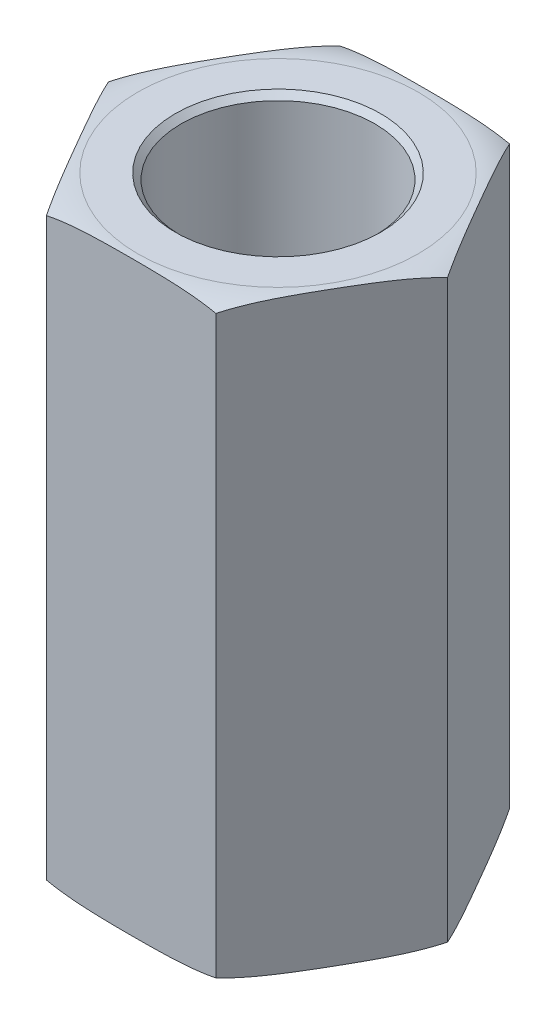
ISO-10303-21;
HEADER;
FILE_DESCRIPTION(('STEP AP214'),'2;1');
FILE_NAME('part.step','',(''),(''),'','','');
FILE_SCHEMA(('AUTOMOTIVE_DESIGN { 1 0 10303 214 1 1 1 1 }'));
ENDSEC;
DATA;
#1=APPLICATION_CONTEXT('core data for automotive mechanical design processes');
#2=APPLICATION_PROTOCOL_DEFINITION('international standard','automotive_design',2000,#1);
#3=PRODUCT_CONTEXT('',#1,'mechanical');
#4=PRODUCT('Part','Part','',(#3));
#5=PRODUCT_RELATED_PRODUCT_CATEGORY('part','',(#4));
#6=PRODUCT_DEFINITION_FORMATION('','',#4);
#7=PRODUCT_DEFINITION_CONTEXT('part definition',#1,'design');
#8=PRODUCT_DEFINITION('design','',#6,#7);
#9=PRODUCT_DEFINITION_SHAPE('','',#8);
#10=(LENGTH_UNIT() NAMED_UNIT(*) SI_UNIT(.MILLI.,.METRE.));
#11=(NAMED_UNIT(*) PLANE_ANGLE_UNIT() SI_UNIT($,.RADIAN.));
#12=(NAMED_UNIT(*) SI_UNIT($,.STERADIAN.) SOLID_ANGLE_UNIT());
#13=UNCERTAINTY_MEASURE_WITH_UNIT(LENGTH_MEASURE(1.E-05),#10,'distance_accuracy_value','');
#14=(GEOMETRIC_REPRESENTATION_CONTEXT(3) GLOBAL_UNCERTAINTY_ASSIGNED_CONTEXT((#13)) GLOBAL_UNIT_ASSIGNED_CONTEXT((#10,
#11,#12)) REPRESENTATION_CONTEXT('',''));
#15=CARTESIAN_POINT('',(0.,0.,0.));
#16=DIRECTION('',(0.,0.,1.));
#17=DIRECTION('',(1.,0.,0.));
#18=AXIS2_PLACEMENT_3D('',#15,#16,#17);
#19=CARTESIAN_POINT('',(3.6661742093542,6.34999999999997,-1.38777878078145E-13));
#20=DIRECTION('',(-0.866025403784443,0.,0.500000000000002));
#21=DIRECTION('',(0.500000000000002,0.,0.866025403784443));
#22=AXIS2_PLACEMENT_3D('',#19,#20,#21);
#23=PLANE('',#22);
#24=DIRECTION('',(0.,1.,0.));
#25=VECTOR('',#24,1.);
#26=CARTESIAN_POINT('',(1.83308710467728,6.34999999999997,-3.17500000000029));
#27=LINE('',#26,#25);
#28=CARTESIAN_POINT('',(1.83308710467703,-6.22300000000003,-3.17500000000004));
#29=VERTEX_POINT('',#28);
#30=CARTESIAN_POINT('',(1.83308710467728,6.22299999999998,-3.17500000000029));
#31=VERTEX_POINT('',#30);
#32=EDGE_CURVE('E144',#29,#31,#27,.T.);
#33=ORIENTED_EDGE('',*,*,#32,.T.);
#34=CARTESIAN_POINT('',(3.66617420935417,6.22299999999998,-1.11022302462516E-13));
#35=CARTESIAN_POINT('',(3.62797961467402,6.23890141489973,-0.0661549785606769));
#36=CARTESIAN_POINT('',(3.58956810864165,6.25248860761058,-0.132685658604));
#37=CARTESIAN_POINT('',(3.51249051795719,6.2758161979403,-0.266187961794495));
#38=CARTESIAN_POINT('',(3.47382473049854,6.28556047713982,-0.333159070187531));
#39=CARTESIAN_POINT('',(3.3964163186788,6.30199665304516,-0.467234372392529));
#40=CARTESIAN_POINT('',(3.35767399633319,6.30869453286697,-0.534338043098334));
#41=CARTESIAN_POINT('',(3.2800983462012,6.31977675729325,-0.668703010557135));
#42=CARTESIAN_POINT('',(3.24126499587778,6.32416045047401,-0.735964346345423));
#43=CARTESIAN_POINT('',(3.16354065964321,6.33124030042632,-0.870586845688255));
#44=CARTESIAN_POINT('',(3.12464965374482,6.33393552375916,-0.937948043861727));
#45=CARTESIAN_POINT('',(3.04685144594599,6.33815319837137,-1.0726984925071));
#46=CARTESIAN_POINT('',(3.00794424351976,6.3396756080272,-1.14008774388971));
#47=CARTESIAN_POINT('',(2.9305151759888,6.34192270588906,-1.27419882283602));
#48=CARTESIAN_POINT('',(2.89199336248941,6.34265524681811,-1.34092056101665));
#49=CARTESIAN_POINT('',(2.8149477834615,6.34357673025744,-1.47436741839156));
#50=CARTESIAN_POINT('',(2.77642401791445,6.34376566589493,-1.54109253761791));
#51=CARTESIAN_POINT('',(2.69935964431018,6.34366599668059,-1.67457194815398));
#52=CARTESIAN_POINT('',(2.66081903631827,6.34337718117658,-1.74132623935056));
#53=CARTESIAN_POINT('',(2.58373908085335,6.34222198621902,-1.87483263846095));
#54=CARTESIAN_POINT('',(2.5451997334125,6.34135559703859,-1.94158474631904));
#55=CARTESIAN_POINT('',(2.46812969629777,6.33878619406568,-2.07507396634301));
#56=CARTESIAN_POINT('',(2.42959900625973,6.33708322716172,-2.14181107913963));
#57=CARTESIAN_POINT('',(2.3525565134091,6.33243872297262,-2.27525259109854));
#58=CARTESIAN_POINT('',(2.31404470975435,6.32949724713574,-2.34195699171947));
#59=CARTESIAN_POINT('',(2.2508420623994,6.32321741247486,-2.45142718811118));
#60=CARTESIAN_POINT('',(2.22613849337012,6.32039801104636,-2.49421502479834));
#61=CARTESIAN_POINT('',(2.17676945272234,6.31386967943045,-2.57972471152133));
#62=CARTESIAN_POINT('',(2.15210397034188,6.31016108091398,-2.62244658019744));
#63=CARTESIAN_POINT('',(2.10282753811699,6.30168027114976,-2.70779586442664));
#64=CARTESIAN_POINT('',(2.07821657107533,6.29690846570092,-2.75042330976622));
#65=CARTESIAN_POINT('',(2.02900094683554,6.28609877125168,-2.83566727147576));
#66=CARTESIAN_POINT('',(2.00439646085468,6.2800577313085,-2.87828349128873));
#67=CARTESIAN_POINT('',(1.95527325900937,6.26651383541622,-2.96336737271525));
#68=CARTESIAN_POINT('',(1.93075459617616,6.25901019780308,-3.00583494247599));
#69=CARTESIAN_POINT('',(1.88182157373177,6.24232035070854,-3.09058942351766));
#70=CARTESIAN_POINT('',(1.8574074405328,6.23313149780335,-3.13287594264113));
#71=CARTESIAN_POINT('',(1.83308710467728,6.22299999999998,-3.17500000000029));
#72=B_SPLINE_CURVE_WITH_KNOTS('',3,(#34,#35,#36,#37,#38,#39,#40,#41,#42,#43,#44,#45,#46,#47,#48,
#49,#50,#51,#52,#53,#54,#55,#56,#57,#58,#59,#60,#61,#62,#63,#64,#65,#66,#67,#68,#69,#70,#71),
.UNSPECIFIED.,.F.,.F.,(4,2,2,2,2,2,2,2,2,2,2,2,2,2,2,2,2,2,4),(0.,0.23397730781796,
0.467717675040727,0.700996973557538,0.934341903229792,1.16781571967244,1.40129782179829,
1.63243665809674,1.86357841666622,2.094822118463,2.32606971471501,2.55730435147405,
2.78852751694421,2.93698369265096,3.08538458004482,3.23372892334593,3.38244598546621,
3.53124274626093,3.68027493713595),.UNSPECIFIED.);
#73=CARTESIAN_POINT('',(3.66617420935417,6.22299999999998,-1.11022302462516E-13));
#74=VERTEX_POINT('',#73);
#75=EDGE_CURVE('E96',#74,#31,#72,.T.);
#76=ORIENTED_EDGE('',*,*,#75,.F.);
#77=DIRECTION('',(0.,1.,0.));
#78=VECTOR('',#77,1.);
#79=CARTESIAN_POINT('',(3.6661742093542,6.34999999999997,-1.38777878078145E-13));
#80=LINE('',#79,#78);
#81=CARTESIAN_POINT('',(3.66617420935417,-6.22300000000003,0.));
#82=VERTEX_POINT('',#81);
#83=EDGE_CURVE('E146',#74,#82,#80,.F.);
#84=ORIENTED_EDGE('',*,*,#83,.T.);
#85=CARTESIAN_POINT('',(1.83308710467728,-6.22300000000003,-3.17500000000029));
#86=CARTESIAN_POINT('',(1.87128169935735,-6.23890141489965,-3.10884502143965));
#87=CARTESIAN_POINT('',(1.90969320538968,-6.25248860761044,-3.0423143413963));
#88=CARTESIAN_POINT('',(1.98677079607412,-6.27581619794014,-2.90881203820579));
#89=CARTESIAN_POINT('',(2.02543658353278,-6.28556047713968,-2.84184092981276));
#90=CARTESIAN_POINT('',(2.10284499535252,-6.30199665304505,-2.70776562760777));
#91=CARTESIAN_POINT('',(2.14158731769813,-6.30869453286687,-2.64066195690196));
#92=CARTESIAN_POINT('',(2.21916296783013,-6.31977675729316,-2.50629698944315));
#93=CARTESIAN_POINT('',(2.25799631815355,-6.32416045047393,-2.43903565365485));
#94=CARTESIAN_POINT('',(2.33572065438812,-6.33124030042626,-2.30441315431201));
#95=CARTESIAN_POINT('',(2.37461166028652,-6.33393552375909,-2.23705195613853));
#96=CARTESIAN_POINT('',(2.45240986808535,-6.33815319837132,-2.10230150749314));
#97=CARTESIAN_POINT('',(2.49131707051159,-6.33967560802715,-2.03491225611053));
#98=CARTESIAN_POINT('',(2.56874613804256,-6.34192270588902,-1.90080117716421));
#99=CARTESIAN_POINT('',(2.60726795154195,-6.34265524681807,-1.83407943898357));
#100=CARTESIAN_POINT('',(2.68431353056987,-6.3435767302574,-1.70063258160865));
#101=CARTESIAN_POINT('',(2.72283729611692,-6.34376566589489,-1.6339074623823));
#102=CARTESIAN_POINT('',(2.79990166972119,-6.34366599668055,-1.50042805184622));
#103=CARTESIAN_POINT('',(2.83844227771311,-6.34337718117654,-1.43367376064963));
#104=CARTESIAN_POINT('',(2.91552223317803,-6.34222198621898,-1.30016736153924));
#105=CARTESIAN_POINT('',(2.95406158061887,-6.34135559703856,-1.23341525368113));
#106=CARTESIAN_POINT('',(3.03113161773364,-6.33878619406561,-1.09992603365717));
#107=CARTESIAN_POINT('',(3.06966230777173,-6.33708322716162,-1.03318892086058));
#108=CARTESIAN_POINT('',(3.14670480062223,-6.3324387229726,-0.899747408901587));
#109=CARTESIAN_POINT('',(3.1852166042768,-6.32949724713584,-0.83304300828054));
#110=CARTESIAN_POINT('',(3.24841925163182,-6.32321741247489,-0.723572811888885));
#111=CARTESIAN_POINT('',(3.27312282066122,-6.3203980110463,-0.680784975201817));
#112=CARTESIAN_POINT('',(3.32249186130908,-6.31386967943032,-0.595275288478904));
#113=CARTESIAN_POINT('',(3.3471573436895,-6.31016108091386,-0.552553419802778));
#114=CARTESIAN_POINT('',(3.39643377591436,-6.30168027114966,-0.467204135573578));
#115=CARTESIAN_POINT('',(3.42104474295602,-6.2969084657008,-0.424576690234015));
#116=CARTESIAN_POINT('',(3.47026036719581,-6.28609877125155,-0.339332728524493));
#117=CARTESIAN_POINT('',(3.49486485317667,-6.28005773130838,-0.296716508711529));
#118=CARTESIAN_POINT('',(3.54398805502196,-6.26651383541608,-0.211632627285027));
#119=CARTESIAN_POINT('',(3.56850671785515,-6.25901019780292,-0.169165057524298));
#120=CARTESIAN_POINT('',(3.61743974029956,-6.24232035070841,-0.0844105764826494));
#121=CARTESIAN_POINT('',(3.64185387349856,-6.23313149780327,-0.0421240573592005));
#122=CARTESIAN_POINT('',(3.66617420935417,-6.22300000000003,0.));
#123=B_SPLINE_CURVE_WITH_KNOTS('',3,(#85,#86,#87,#88,#89,#90,#91,#92,#93,#94,#95,#96,#97,#98,
#99,#100,#101,#102,#103,#104,#105,#106,#107,#108,#109,#110,#111,#112,#113,#114,#115,#116,#117,
#118,#119,#120,#121,#122),.UNSPECIFIED.,.F.,.F.,(4,2,2,2,2,2,2,2,2,2,2,2,2,2,2,2,2,2,4),(0.,
0.233977307817952,0.467717675040719,0.700996973557547,0.934341903229817,1.16781571967249,
1.40129782179836,1.63243665809683,1.86357841666633,2.09482211846312,2.32606971471515,
2.55730435147419,2.78852751694437,2.93698369265108,3.08538458004492,3.233728923346,
3.38244598546625,3.53124274626094,3.68027493713592),.UNSPECIFIED.);
#124=EDGE_CURVE('E224',#29,#82,#123,.T.);
#125=ORIENTED_EDGE('',*,*,#124,.F.);
#126=EDGE_LOOP('',(#33,#76,#84,#125));
#127=FACE_BOUND('',#126,.T.);
#128=ADVANCED_FACE('F16',(#127),#23,.F.);
#129=CARTESIAN_POINT('',(1.83308710467711,6.35000000000002,3.17499999999996));
#130=DIRECTION('',(-0.866025403784444,0.,-0.500000000000003));
#131=DIRECTION('',(-0.500000000000003,0.,0.866025403784444));
#132=AXIS2_PLACEMENT_3D('',#129,#130,#131);
#133=PLANE('',#132);
#134=ORIENTED_EDGE('',*,*,#83,.F.);
#135=CARTESIAN_POINT('',(1.83308710467711,6.22299999999998,3.17499999999996));
#136=CARTESIAN_POINT('',(1.87128169935729,6.23890141489967,3.10884502143939));
#137=CARTESIAN_POINT('',(1.90969320538967,6.25248860761049,3.04231434139607));
#138=CARTESIAN_POINT('',(1.98677079607413,6.2758161979402,2.90881203820558));
#139=CARTESIAN_POINT('',(2.02543658353278,6.28556047713974,2.84184092981254));
#140=CARTESIAN_POINT('',(2.10284499535251,6.3019966530451,2.70776562760755));
#141=CARTESIAN_POINT('',(2.14158731769812,6.30869453286691,2.64066195690174));
#142=CARTESIAN_POINT('',(2.21916296783012,6.3197767572932,2.50629698944294));
#143=CARTESIAN_POINT('',(2.25799631815354,6.32416045047396,2.43903565365465));
#144=CARTESIAN_POINT('',(2.33572065438811,6.33124030042629,2.30441315431181));
#145=CARTESIAN_POINT('',(2.3746116602865,6.33393552375912,2.23705195613834));
#146=CARTESIAN_POINT('',(2.45240986808533,6.33815319837135,2.10230150749296));
#147=CARTESIAN_POINT('',(2.49131707051157,6.33967560802718,2.03491225611035));
#148=CARTESIAN_POINT('',(2.56874613804253,6.34192270588904,1.90080117716404));
#149=CARTESIAN_POINT('',(2.60726795154192,6.34265524681809,1.8340794389834));
#150=CARTESIAN_POINT('',(2.68431353056983,6.34357673025742,1.7006325816085));
#151=CARTESIAN_POINT('',(2.72283729611688,6.34376566589491,1.63390746238214));
#152=CARTESIAN_POINT('',(2.79990166972115,6.34366599668057,1.50042805184608));
#153=CARTESIAN_POINT('',(2.83844227771306,6.34337718117657,1.43367376064949));
#154=CARTESIAN_POINT('',(2.91552223317798,6.34222198621901,1.3001673615391));
#155=CARTESIAN_POINT('',(2.95406158061883,6.34135559703858,1.233415253681));
#156=CARTESIAN_POINT('',(3.03113161773358,6.33878619406565,1.09992603365704));
#157=CARTESIAN_POINT('',(3.06966230777165,6.33708322716169,1.03318892086044));
#158=CARTESIAN_POINT('',(3.14670480062219,6.33243872297261,0.899747408901476));
#159=CARTESIAN_POINT('',(3.18521660427681,6.32949724713575,0.833043008280466));
#160=CARTESIAN_POINT('',(3.24841925163181,6.32321741247486,0.723572811888789));
#161=CARTESIAN_POINT('',(3.27312282066118,6.32039801104634,0.68078497520169));
#162=CARTESIAN_POINT('',(3.32249186130902,6.31386967943042,0.595275288478746));
#163=CARTESIAN_POINT('',(3.34715734368946,6.31016108091395,0.552553419802622));
#164=CARTESIAN_POINT('',(3.39643377591432,6.30168027114973,0.467204135573417));
#165=CARTESIAN_POINT('',(3.42104474295599,6.29690846570089,0.424576690233846));
#166=CARTESIAN_POINT('',(3.47026036719578,6.28609877125165,0.339332728524313));
#167=CARTESIAN_POINT('',(3.49486485317664,6.28005773130848,0.296716508711345));
#168=CARTESIAN_POINT('',(3.54398805502194,6.26651383541619,0.211632627284831));
#169=CARTESIAN_POINT('',(3.56850671785514,6.25901019780305,0.169165057524093));
#170=CARTESIAN_POINT('',(3.61743974029956,6.24232035070852,0.0844105764824377));
#171=CARTESIAN_POINT('',(3.64185387349856,6.23313149780334,0.0421240573589902));
#172=CARTESIAN_POINT('',(3.66617420935417,6.22299999999998,-1.11022302462516E-13));
#173=B_SPLINE_CURVE_WITH_KNOTS('',3,(#135,#136,#137,#138,#139,#140,#141,#142,#143,#144,#145,
#146,#147,#148,#149,#150,#151,#152,#153,#154,#155,#156,#157,#158,#159,#160,#161,#162,#163,#164,
#165,#166,#167,#168,#169,#170,#171,#172),.UNSPECIFIED.,.F.,.F.,(4,2,2,2,2,2,2,2,2,2,2,2,2,2,2,2,
2,2,4),(0.,0.233977307817958,0.467717675040725,0.70099697355754,0.934341903229799,
1.16781571967245,1.40129782179831,1.63243665809676,1.86357841666625,2.09482211846303,
2.32606971471505,2.55730435147409,2.78852751694425,2.93698369265099,3.08538458004484,
3.23372892334594,3.38244598546621,3.53124274626092,3.68027493713592),.UNSPECIFIED.);
#174=CARTESIAN_POINT('',(1.83308710467711,6.22299999999998,3.17499999999996));
#175=VERTEX_POINT('',#174);
#176=EDGE_CURVE('E217',#175,#74,#173,.T.);
#177=ORIENTED_EDGE('',*,*,#176,.F.);
#178=DIRECTION('',(0.,1.,0.));
#179=VECTOR('',#178,1.);
#180=CARTESIAN_POINT('',(1.83308710467711,6.35000000000002,3.17499999999996));
#181=LINE('',#180,#179);
#182=CARTESIAN_POINT('',(1.83308710467708,-6.22299999999998,3.17500000000001));
#183=VERTEX_POINT('',#182);
#184=EDGE_CURVE('E141',#175,#183,#181,.F.);
#185=ORIENTED_EDGE('',*,*,#184,.T.);
#186=CARTESIAN_POINT('',(3.66617420935417,-6.22300000000003,0.));
#187=CARTESIAN_POINT('',(3.627979614674,-6.23890141489968,0.0661549785604945));
#188=CARTESIAN_POINT('',(3.58956810864162,-6.25248860761048,0.132685658603822));
#189=CARTESIAN_POINT('',(3.51249051795716,-6.27581619794018,0.26618796179432));
#190=CARTESIAN_POINT('',(3.47382473049851,-6.28556047713972,0.333159070187355));
#191=CARTESIAN_POINT('',(3.39641631867877,-6.30199665304508,0.467234372392358));
#192=CARTESIAN_POINT('',(3.35767399633316,-6.3086945328669,0.534338043098168));
#193=CARTESIAN_POINT('',(3.28009834620116,-6.31977675729318,0.66870301055698));
#194=CARTESIAN_POINT('',(3.24126499587774,-6.32416045047395,0.735964346345273));
#195=CARTESIAN_POINT('',(3.16354065964316,-6.33124030042628,0.870586845688117));
#196=CARTESIAN_POINT('',(3.12464965374477,-6.33393552375911,0.937948043861596));
#197=CARTESIAN_POINT('',(3.04685144594593,-6.33815319837133,1.07269849250699));
#198=CARTESIAN_POINT('',(3.00794424351969,-6.33967560802717,1.1400877438896));
#199=CARTESIAN_POINT('',(2.93051517598872,-6.34192270588903,1.27419882283592));
#200=CARTESIAN_POINT('',(2.89199336248933,-6.34265524681808,1.34092056101656));
#201=CARTESIAN_POINT('',(2.81494778346141,-6.34357673025741,1.47436741839148));
#202=CARTESIAN_POINT('',(2.77642401791437,-6.3437656658949,1.54109253761783));
#203=CARTESIAN_POINT('',(2.69935964431009,-6.34366599668055,1.67457194815391));
#204=CARTESIAN_POINT('',(2.66081903631818,-6.34337718117655,1.7413262393505));
#205=CARTESIAN_POINT('',(2.58373908085325,-6.34222198621899,1.87483263846089));
#206=CARTESIAN_POINT('',(2.5451997334124,-6.34135559703857,1.94158474631899));
#207=CARTESIAN_POINT('',(2.46812969629765,-6.33878619406562,2.07507396634296));
#208=CARTESIAN_POINT('',(2.4295990062596,-6.33708322716163,2.14181107913957));
#209=CARTESIAN_POINT('',(2.35255651340902,-6.33243872297261,2.27525259109852));
#210=CARTESIAN_POINT('',(2.31404470975434,-6.32949724713583,2.34195699171951));
#211=CARTESIAN_POINT('',(2.25084206239937,-6.3232174124749,2.45142718811119));
#212=CARTESIAN_POINT('',(2.22613849337004,-6.32039801104631,2.4942150247983));
#213=CARTESIAN_POINT('',(2.17676945272223,-6.31386967943034,2.57972471152125));
#214=CARTESIAN_POINT('',(2.15210397034179,-6.31016108091388,2.62244658019736));
#215=CARTESIAN_POINT('',(2.10282753811692,-6.30168027114968,2.70779586442655));
#216=CARTESIAN_POINT('',(2.07821657107526,-6.29690846570083,2.75042330976612));
#217=CARTESIAN_POINT('',(2.02900094683548,-6.28609877125158,2.83566727147564));
#218=CARTESIAN_POINT('',(2.00439646085462,-6.2800577313084,2.8782834912886));
#219=CARTESIAN_POINT('',(1.95527325900933,-6.2665138354161,2.9633673727151));
#220=CARTESIAN_POINT('',(1.93075459617614,-6.25901019780295,3.00583494247584));
#221=CARTESIAN_POINT('',(1.88182157373172,-6.24232035070843,3.09058942351748));
#222=CARTESIAN_POINT('',(1.85740744053271,-6.23313149780327,3.13287594264092));
#223=CARTESIAN_POINT('',(1.83308710467708,-6.22299999999998,3.17500000000001));
#224=B_SPLINE_CURVE_WITH_KNOTS('',3,(#186,#187,#188,#189,#190,#191,#192,#193,#194,#195,#196,
#197,#198,#199,#200,#201,#202,#203,#204,#205,#206,#207,#208,#209,#210,#211,#212,#213,#214,#215,
#216,#217,#218,#219,#220,#221,#222,#223),.UNSPECIFIED.,.F.,.F.,(4,2,2,2,2,2,2,2,2,2,2,2,2,2,2,2,
2,2,4),(0.,0.23397730781796,0.467717675040731,0.700996973557561,0.934341903229834,
1.1678157196725,1.40129782179838,1.63243665809685,1.86357841666635,2.09482211846314,
2.32606971471517,2.55730435147422,2.78852751694439,2.9369836926511,3.08538458004494,
3.23372892334602,3.38244598546627,3.53124274626096,3.68027493713594),.UNSPECIFIED.);
#225=EDGE_CURVE('E246',#82,#183,#224,.T.);
#226=ORIENTED_EDGE('',*,*,#225,.F.);
#227=EDGE_LOOP('',(#134,#177,#185,#226));
#228=FACE_BOUND('',#227,.T.);
#229=ADVANCED_FACE('F221',(#228),#133,.F.);
#230=CARTESIAN_POINT('',(1.83308710467728,6.34999999999997,-3.17500000000029));
#231=DIRECTION('',(0.,0.,1.));
#232=DIRECTION('',(1.,0.,0.));
#233=AXIS2_PLACEMENT_3D('',#230,#231,#232);
#234=PLANE('',#233);
#235=DIRECTION('',(0.,1.,0.));
#236=VECTOR('',#235,1.);
#237=CARTESIAN_POINT('',(-1.83308710467706,6.35000000000002,-3.17500000000001));
#238=LINE('',#237,#236);
#239=CARTESIAN_POINT('',(-1.83308710467706,-6.22299999999998,-3.17500000000001));
#240=VERTEX_POINT('',#239);
#241=CARTESIAN_POINT('',(-1.83308710467706,6.22299999999998,-3.17500000000001));
#242=VERTEX_POINT('',#241);
#243=EDGE_CURVE('E103',#240,#242,#238,.T.);
#244=ORIENTED_EDGE('',*,*,#243,.T.);
#245=CARTESIAN_POINT('',(1.83308710467728,6.22299999999998,-3.17500000000029));
#246=CARTESIAN_POINT('',(1.73237579828705,6.24394001415181,-3.17500000000029));
#247=CARTESIAN_POINT('',(1.63096506893506,6.26088534953277,-3.17500000000029));
#248=CARTESIAN_POINT('',(1.42767146651487,6.28849716439847,-3.17500000000029));
#249=CARTESIAN_POINT('',(1.32579191427271,6.29918756587534,-3.17500000000029));
#250=CARTESIAN_POINT('',(1.12177634709152,6.31612804080796,-3.17500000000029));
#251=CARTESIAN_POINT('',(1.01964056643393,6.3223812707189,-3.17500000000029));
#252=CARTESIAN_POINT('',(0.815663681397492,6.33190280641835,-3.17500000000028));
#253=CARTESIAN_POINT('',(0.713823115514678,6.33518340449992,-3.17500000000027));
#254=CARTESIAN_POINT('',(0.510018485441734,6.3399454848703,-3.17500000000031));
#255=CARTESIAN_POINT('',(0.408054390578049,6.34142541008819,-3.17500000000037));
#256=CARTESIAN_POINT('',(0.20406020033792,6.34331468183793,-3.17500000000021));
#257=CARTESIAN_POINT('',(0.102030100168974,6.34372342414918,-3.17499999999998));
#258=CARTESIAN_POINT('',(-0.102030100168908,6.34372342414918,-3.17499999999998));
#259=CARTESIAN_POINT('',(-0.204060200337843,6.34331468183792,-3.17500000000021));
#260=CARTESIAN_POINT('',(-0.40805439057795,6.34142541008818,-3.17500000000037));
#261=CARTESIAN_POINT('',(-0.510018485441625,6.33994548487029,-3.17500000000031));
#262=CARTESIAN_POINT('',(-0.713823115514547,6.33518340449991,-3.17500000000027));
#263=CARTESIAN_POINT('',(-0.815663681397349,6.33190280641834,-3.17500000000028));
#264=CARTESIAN_POINT('',(-1.01964056643377,6.32238127071888,-3.17500000000029));
#265=CARTESIAN_POINT('',(-1.12177634709135,6.31612804080794,-3.17500000000028));
#266=CARTESIAN_POINT('',(-1.32579191427251,6.29918756587532,-3.17500000000029));
#267=CARTESIAN_POINT('',(-1.42767146651466,6.28849716439844,-3.17500000000032));
#268=CARTESIAN_POINT('',(-1.63096506893483,6.26088534953274,-3.17500000000026));
#269=CARTESIAN_POINT('',(-1.7323757982868,6.24394001415179,-3.17500000000018));
#270=CARTESIAN_POINT('',(-1.83308710467703,6.22299999999998,-3.17499999999998));
#271=B_SPLINE_CURVE_WITH_KNOTS('',3,(#245,#246,#247,#248,#249,#250,#251,#252,#253,#254,#255,
#256,#257,#258,#259,#260,#261,#262,#263,#264,#265,#266,#267,#268,#269,#270),.UNSPECIFIED.,.F.,
.F.,(4,2,2,2,2,2,2,2,2,2,2,2,4),(0.,0.308333242342845,0.615479423308305,0.922406891130111,
1.22805929620863,1.53397581645233,1.84006485747909,2.14615389850582,2.45207041874948,
2.75772282382797,3.06465029164974,3.37179647261517,3.68012971495798),.UNSPECIFIED.);
#272=EDGE_CURVE('E88',#31,#242,#271,.T.);
#273=ORIENTED_EDGE('',*,*,#272,.F.);
#274=ORIENTED_EDGE('',*,*,#32,.F.);
#275=CARTESIAN_POINT('',(-1.83308710467706,-6.22299999999998,-3.17500000000001));
#276=CARTESIAN_POINT('',(-1.73237579828682,-6.24394001415172,-3.17500000000019));
#277=CARTESIAN_POINT('',(-1.63096506893483,-6.26088534953265,-3.17500000000026));
#278=CARTESIAN_POINT('',(-1.42767146651465,-6.28849716439834,-3.17500000000032));
#279=CARTESIAN_POINT('',(-1.32579191427249,-6.29918756587524,-3.1750000000003));
#280=CARTESIAN_POINT('',(-1.12177634709131,-6.31612804080788,-3.17500000000028));
#281=CARTESIAN_POINT('',(-1.01964056643372,-6.32238127071882,-3.17500000000029));
#282=CARTESIAN_POINT('',(-0.815663681397281,-6.33190280641829,-3.17500000000029));
#283=CARTESIAN_POINT('',(-0.713823115514469,-6.33518340449986,-3.17500000000029));
#284=CARTESIAN_POINT('',(-0.510018485441529,-6.33994548487025,-3.17500000000029));
#285=CARTESIAN_POINT('',(-0.408054390577846,-6.34142541008814,-3.17500000000028));
#286=CARTESIAN_POINT('',(-0.204060200337721,-6.3433146818379,-3.1750000000003));
#287=CARTESIAN_POINT('',(-0.102030100168777,-6.34372342414918,-3.17500000000032));
#288=CARTESIAN_POINT('',(0.10203010016909,-6.34372342414918,-3.17500000000032));
#289=CARTESIAN_POINT('',(0.204060200338014,-6.34331468183789,-3.1750000000003));
#290=CARTESIAN_POINT('',(0.408054390578097,-6.34142541008813,-3.17500000000028));
#291=CARTESIAN_POINT('',(0.51001848544176,-6.33994548487024,-3.17500000000029));
#292=CARTESIAN_POINT('',(0.71382311551466,-6.33518340449986,-3.17500000000029));
#293=CARTESIAN_POINT('',(0.815663681397452,-6.33190280641828,-3.17500000000029));
#294=CARTESIAN_POINT('',(1.01964056643385,-6.32238127071882,-3.17500000000029));
#295=CARTESIAN_POINT('',(1.12177634709142,-6.31612804080787,-3.17500000000028));
#296=CARTESIAN_POINT('',(1.32579191427256,-6.29918756587523,-3.1750000000003));
#297=CARTESIAN_POINT('',(1.42767146651469,-6.28849716439833,-3.17500000000031));
#298=CARTESIAN_POINT('',(1.63096506893484,-6.26088534953266,-3.17500000000026));
#299=CARTESIAN_POINT('',(1.7323757982868,-6.24394001415174,-3.1750000000002));
#300=CARTESIAN_POINT('',(1.83308710467703,-6.22300000000003,-3.17500000000004));
#301=B_SPLINE_CURVE_WITH_KNOTS('',3,(#275,#276,#277,#278,#279,#280,#281,#282,#283,#284,#285,
#286,#287,#288,#289,#290,#291,#292,#293,#294,#295,#296,#297,#298,#299,#300),.UNSPECIFIED.,.F.,
.F.,(4,2,2,2,2,2,2,2,2,2,2,2,4),(0.,0.308333242342829,0.615479423308284,0.922406891130085,
1.2280592962086,1.53397581645229,1.84006485747905,2.14615389850574,2.45207041874936,
2.75772282382782,3.06465029164956,3.37179647261496,3.68012971495772),.UNSPECIFIED.);
#302=EDGE_CURVE('E105',#240,#29,#301,.T.);
#303=ORIENTED_EDGE('',*,*,#302,.F.);
#304=EDGE_LOOP('',(#244,#273,#274,#303));
#305=FACE_BOUND('',#304,.T.);
#306=ADVANCED_FACE('F104',(#305),#234,.F.);
#307=CARTESIAN_POINT('',(-1.83308710467692,6.35000000000002,3.17499999999973));
#308=DIRECTION('',(0.,0.,-1.));
#309=DIRECTION('',(-1.,0.,0.));
#310=AXIS2_PLACEMENT_3D('',#307,#308,#309);
#311=PLANE('',#310);
#312=ORIENTED_EDGE('',*,*,#184,.F.);
#313=CARTESIAN_POINT('',(-1.83308710467694,6.22300000000003,3.17499999999979));
#314=CARTESIAN_POINT('',(-1.73237579828672,6.24394001415181,3.17499999999975));
#315=CARTESIAN_POINT('',(-1.63096506893475,6.26088534953274,3.17499999999974));
#316=CARTESIAN_POINT('',(-1.4276714665146,6.28849716439842,3.17499999999973));
#317=CARTESIAN_POINT('',(-1.32579191427246,6.29918756587531,3.17499999999973));
#318=CARTESIAN_POINT('',(-1.1217763470913,6.31612804080794,3.17499999999973));
#319=CARTESIAN_POINT('',(-1.01964056643373,6.32238127071888,3.17499999999973));
#320=CARTESIAN_POINT('',(-0.815663681397325,6.33190280641833,3.17499999999974));
#321=CARTESIAN_POINT('',(-0.713823115514529,6.3351834044999,3.17499999999975));
#322=CARTESIAN_POINT('',(-0.51001848544162,6.33994548487028,3.17499999999972));
#323=CARTESIAN_POINT('',(-0.408054390577952,6.34142541008818,3.17499999999967));
#324=CARTESIAN_POINT('',(-0.204060200337858,6.34331468183792,3.17499999999979));
#325=CARTESIAN_POINT('',(-0.102030100168929,6.34372342414918,3.17499999999996));
#326=CARTESIAN_POINT('',(0.102030100168939,6.34372342414918,3.17499999999996));
#327=CARTESIAN_POINT('',(0.204060200337877,6.34331468183792,3.17499999999979));
#328=CARTESIAN_POINT('',(0.40805439057799,6.34142541008818,3.17499999999967));
#329=CARTESIAN_POINT('',(0.510018485441668,6.33994548487029,3.17499999999972));
#330=CARTESIAN_POINT('',(0.713823115514597,6.33518340449991,3.17499999999975));
#331=CARTESIAN_POINT('',(0.815663681397403,6.33190280641834,3.17499999999973));
#332=CARTESIAN_POINT('',(1.01964056643383,6.32238127071889,3.17499999999973));
#333=CARTESIAN_POINT('',(1.12177634709141,6.31612804080796,3.17499999999973));
#334=CARTESIAN_POINT('',(1.32579191427258,6.29918756587534,3.17499999999973));
#335=CARTESIAN_POINT('',(1.42767146651474,6.28849716439847,3.17499999999971));
#336=CARTESIAN_POINT('',(1.63096506893491,6.26088534953278,3.17499999999975));
#337=CARTESIAN_POINT('',(1.73237579828689,6.24394001415182,3.17499999999981));
#338=CARTESIAN_POINT('',(1.83308710467711,6.22299999999998,3.17499999999996));
#339=B_SPLINE_CURVE_WITH_KNOTS('',3,(#313,#314,#315,#316,#317,#318,#319,#320,#321,#322,#323,
#324,#325,#326,#327,#328,#329,#330,#331,#332,#333,#334,#335,#336,#337,#338),.UNSPECIFIED.,.F.,
.F.,(4,2,2,2,2,2,2,2,2,2,2,2,4),(0.,0.308333242342787,0.615479423308195,0.922406891129948,
1.22805929620842,1.53397581645206,1.84006485747877,2.14615389850551,2.45207041874918,
2.75772282382768,3.06465029164946,3.3717964726149,3.68012971495772),.UNSPECIFIED.);
#340=CARTESIAN_POINT('',(-1.83308710467694,6.22300000000003,3.17499999999979));
#341=VERTEX_POINT('',#340);
#342=EDGE_CURVE('E99',#341,#175,#339,.T.);
#343=ORIENTED_EDGE('',*,*,#342,.F.);
#344=DIRECTION('',(0.,1.,0.));
#345=VECTOR('',#344,1.);
#346=CARTESIAN_POINT('',(-1.83308710467692,6.35000000000002,3.17499999999973));
#347=LINE('',#346,#345);
#348=CARTESIAN_POINT('',(-1.83308710467692,-6.22299999999998,3.17499999999976));
#349=VERTEX_POINT('',#348);
#350=EDGE_CURVE('E107',#341,#349,#347,.F.);
#351=ORIENTED_EDGE('',*,*,#350,.T.);
#352=CARTESIAN_POINT('',(1.83308710467708,-6.22299999999998,3.17500000000001));
#353=CARTESIAN_POINT('',(1.73237579828686,-6.24394001415183,3.17499999999983));
#354=CARTESIAN_POINT('',(1.63096506893489,-6.2608853495328,3.17499999999976));
#355=CARTESIAN_POINT('',(1.42767146651472,-6.2884971643985,3.1749999999997));
#356=CARTESIAN_POINT('',(1.32579191427256,-6.29918756587537,3.17499999999972));
#357=CARTESIAN_POINT('',(1.12177634709139,-6.31612804080798,3.17499999999974));
#358=CARTESIAN_POINT('',(1.01964056643381,-6.32238127071892,3.17499999999973));
#359=CARTESIAN_POINT('',(0.815663681397391,-6.33190280641836,3.17499999999973));
#360=CARTESIAN_POINT('',(0.713823115514587,-6.33518340449993,3.17499999999975));
#361=CARTESIAN_POINT('',(0.510018485441661,-6.33994548487031,3.17499999999972));
#362=CARTESIAN_POINT('',(0.408054390577985,-6.3414254100882,3.17499999999967));
#363=CARTESIAN_POINT('',(0.204060200337875,-6.34331468183793,3.17499999999979));
#364=CARTESIAN_POINT('',(0.102030100168937,-6.34372342414918,3.17499999999996));
#365=CARTESIAN_POINT('',(-0.102030100168928,-6.34372342414918,3.17499999999996));
#366=CARTESIAN_POINT('',(-0.204060200337856,-6.34331468183793,3.17499999999979));
#367=CARTESIAN_POINT('',(-0.408054390577948,-6.3414254100882,3.17499999999967));
#368=CARTESIAN_POINT('',(-0.510018485441615,-6.33994548487031,3.17499999999972));
#369=CARTESIAN_POINT('',(-0.713823115514523,-6.33518340449993,3.17499999999975));
#370=CARTESIAN_POINT('',(-0.815663681397318,-6.33190280641837,3.17499999999974));
#371=CARTESIAN_POINT('',(-1.01964056643372,-6.32238127071892,3.17499999999973));
#372=CARTESIAN_POINT('',(-1.12177634709129,-6.31612804080798,3.17499999999973));
#373=CARTESIAN_POINT('',(-1.32579191427244,-6.29918756587538,3.17499999999973));
#374=CARTESIAN_POINT('',(-1.42767146651459,-6.28849716439851,3.17499999999973));
#375=CARTESIAN_POINT('',(-1.63096506893474,-6.26088534953281,3.17499999999974));
#376=CARTESIAN_POINT('',(-1.73237579828671,-6.24394001415185,3.17499999999974));
#377=CARTESIAN_POINT('',(-1.83308710467692,-6.22299999999998,3.17499999999976));
#378=B_SPLINE_CURVE_WITH_KNOTS('',3,(#352,#353,#354,#355,#356,#357,#358,#359,#360,#361,#362,
#363,#364,#365,#366,#367,#368,#369,#370,#371,#372,#373,#374,#375,#376,#377),.UNSPECIFIED.,.F.,
.F.,(4,2,2,2,2,2,2,2,2,2,2,2,4),(0.,0.30833324234282,0.615479423308253,0.922406891130031,
1.22805929620853,1.53397581645219,1.84006485747893,2.14615389850563,2.45207041874927,
2.75772282382774,3.06465029164949,3.37179647261489,3.68012971495769),.UNSPECIFIED.);
#379=EDGE_CURVE('E211',#183,#349,#378,.T.);
#380=ORIENTED_EDGE('',*,*,#379,.F.);
#381=EDGE_LOOP('',(#312,#343,#351,#380));
#382=FACE_BOUND('',#381,.T.);
#383=ADVANCED_FACE('F379',(#382),#311,.F.);
#384=CARTESIAN_POINT('',(-3.66617420935408,6.35000000000002,0.));
#385=DIRECTION('',(0.866025403784444,0.,-0.500000000000001));
#386=DIRECTION('',(-0.500000000000001,0.,-0.866025403784444));
#387=AXIS2_PLACEMENT_3D('',#384,#385,#386);
#388=PLANE('',#387);
#389=ORIENTED_EDGE('',*,*,#350,.F.);
#390=CARTESIAN_POINT('',(-3.66617420935408,6.22300000000003,0.));
#391=CARTESIAN_POINT('',(-3.62797961467391,6.23890141489967,0.0661549785605655));
#392=CARTESIAN_POINT('',(-3.58956810864153,6.25248860761047,0.132685658603885));
#393=CARTESIAN_POINT('',(-3.51249051795707,6.27581619794017,0.266187961794371));
#394=CARTESIAN_POINT('',(-3.47382473049842,6.2855604771397,0.333159070187402));
#395=CARTESIAN_POINT('',(-3.39641631867869,6.30199665304507,0.467234372392395));
#396=CARTESIAN_POINT('',(-3.35767399633308,6.30869453286688,0.534338043098202));
#397=CARTESIAN_POINT('',(-3.28009834620109,6.31977675729317,0.668703010557004));
#398=CARTESIAN_POINT('',(-3.24126499587766,6.32416045047393,0.735964346345294));
#399=CARTESIAN_POINT('',(-3.1635406596431,6.33124030042626,0.87058684568813));
#400=CARTESIAN_POINT('',(-3.12464965374471,6.33393552375909,0.937948043861605));
#401=CARTESIAN_POINT('',(-3.04685144594587,6.33815319837132,1.07269849250699));
#402=CARTESIAN_POINT('',(-3.00794424351963,6.33967560802715,1.1400877438896));
#403=CARTESIAN_POINT('',(-2.93051517598867,6.34192270588901,1.27419882283591));
#404=CARTESIAN_POINT('',(-2.89199336248928,6.34265524681806,1.34092056101655));
#405=CARTESIAN_POINT('',(-2.81494778346137,6.34357673025739,1.47436741839146));
#406=CARTESIAN_POINT('',(-2.77642401791432,6.34376566589488,1.54109253761781));
#407=CARTESIAN_POINT('',(-2.69935964431005,6.34366599668054,1.67457194815388));
#408=CARTESIAN_POINT('',(-2.66081903631814,6.34337718117653,1.74132623935046));
#409=CARTESIAN_POINT('',(-2.58373908085322,6.34222198621897,1.87483263846085));
#410=CARTESIAN_POINT('',(-2.54519973341237,6.34135559703855,1.94158474631895));
#411=CARTESIAN_POINT('',(-2.46812969629763,6.3387861940656,2.07507396634291));
#412=CARTESIAN_POINT('',(-2.42959900625958,6.3370832271616,2.14181107913952));
#413=CARTESIAN_POINT('',(-2.35255651340899,6.33243872297259,2.27525259109845));
#414=CARTESIAN_POINT('',(-2.31404470975431,6.32949724713584,2.34195699171943));
#415=CARTESIAN_POINT('',(-2.25084206239935,6.32321741247489,2.45142718811111));
#416=CARTESIAN_POINT('',(-2.22613849337002,6.32039801104628,2.49421502479821));
#417=CARTESIAN_POINT('',(-2.17676945272223,6.31386967943029,2.57972471152115));
#418=CARTESIAN_POINT('',(-2.15210397034179,6.31016108091384,2.62244658019726));
#419=CARTESIAN_POINT('',(-2.10282753811692,6.30168027114963,2.70779586442645));
#420=CARTESIAN_POINT('',(-2.07821657107526,6.29690846570078,2.75042330976601));
#421=CARTESIAN_POINT('',(-2.02900094683548,6.28609877125152,2.83566727147552));
#422=CARTESIAN_POINT('',(-2.00439646085462,6.28005773130835,2.87828349128848));
#423=CARTESIAN_POINT('',(-1.95527325900935,6.26651383541604,2.96336737271498));
#424=CARTESIAN_POINT('',(-1.93075459617617,6.25901019780288,3.00583494247571));
#425=CARTESIAN_POINT('',(-1.88182157373173,6.24232035070838,3.09058942351733));
#426=CARTESIAN_POINT('',(-1.85740744053268,6.23313149780325,3.13287594264075));
#427=CARTESIAN_POINT('',(-1.83308710467694,6.22300000000003,3.17499999999979));
#428=B_SPLINE_CURVE_WITH_KNOTS('',3,(#390,#391,#392,#393,#394,#395,#396,#397,#398,#399,#400,
#401,#402,#403,#404,#405,#406,#407,#408,#409,#410,#411,#412,#413,#414,#415,#416,#417,#418,#419,
#420,#421,#422,#423,#424,#425,#426,#427),.UNSPECIFIED.,.F.,.F.,(4,2,2,2,2,2,2,2,2,2,2,2,2,2,2,2,
2,2,4),(0.,0.23397730781794,0.467717675040694,0.700996973557508,0.934341903229767,
1.16781571967242,1.40129782179829,1.63243665809675,1.86357841666623,2.09482211846301,
2.32606971471502,2.55730435147406,2.78852751694421,2.93698369265091,3.08538458004474,
3.23372892334581,3.38244598546604,3.53124274626072,3.68027493713568),.UNSPECIFIED.);
#429=CARTESIAN_POINT('',(-3.66617420935411,6.22299999999998,0.));
#430=VERTEX_POINT('',#429);
#431=EDGE_CURVE('E100',#430,#341,#428,.T.);
#432=ORIENTED_EDGE('',*,*,#431,.F.);
#433=DIRECTION('',(0.,1.,0.));
#434=VECTOR('',#433,1.);
#435=CARTESIAN_POINT('',(-3.66617420935408,6.35000000000002,0.));
#436=LINE('',#435,#434);
#437=CARTESIAN_POINT('',(-3.66617420935414,-6.22299999999998,0.));
#438=VERTEX_POINT('',#437);
#439=EDGE_CURVE('E82',#430,#438,#436,.F.);
#440=ORIENTED_EDGE('',*,*,#439,.T.);
#441=CARTESIAN_POINT('',(-1.83308710467692,-6.22299999999998,3.17499999999976));
#442=CARTESIAN_POINT('',(-1.87128169935721,-6.23890141489969,3.10884502143927));
#443=CARTESIAN_POINT('',(-1.90969320538963,-6.25248860761052,3.04231434139599));
#444=CARTESIAN_POINT('',(-1.98677079607413,-6.27581619794023,2.90881203820552));
#445=CARTESIAN_POINT('',(-2.02543658353276,-6.28556047713976,2.84184092981248));
#446=CARTESIAN_POINT('',(-2.10284499535249,-6.30199665304511,2.70776562760748));
#447=CARTESIAN_POINT('',(-2.1415873176981,-6.30869453286692,2.64066195690168));
#448=CARTESIAN_POINT('',(-2.21916296783009,-6.3197767572932,2.50629698944288));
#449=CARTESIAN_POINT('',(-2.25799631815351,-6.32416045047397,2.4390356536546));
#450=CARTESIAN_POINT('',(-2.33572065438808,-6.33124030042629,2.30441315431177));
#451=CARTESIAN_POINT('',(-2.37461166028646,-6.33393552375912,2.2370519561383));
#452=CARTESIAN_POINT('',(-2.4524098680853,-6.33815319837134,2.10230150749292));
#453=CARTESIAN_POINT('',(-2.49131707051153,-6.33967560802717,2.03491225611031));
#454=CARTESIAN_POINT('',(-2.56874613804249,-6.34192270588903,1.900801177164));
#455=CARTESIAN_POINT('',(-2.60726795154188,-6.34265524681808,1.83407943898337));
#456=CARTESIAN_POINT('',(-2.68431353056979,-6.34357673025741,1.70063258160847));
#457=CARTESIAN_POINT('',(-2.72283729611683,-6.3437656658949,1.63390746238212));
#458=CARTESIAN_POINT('',(-2.7999016697211,-6.34366599668056,1.50042805184606));
#459=CARTESIAN_POINT('',(-2.83844227771301,-6.34337718117656,1.43367376064947));
#460=CARTESIAN_POINT('',(-2.91552223317793,-6.34222198621899,1.30016736153909));
#461=CARTESIAN_POINT('',(-2.95406158061877,-6.34135559703857,1.233415253681));
#462=CARTESIAN_POINT('',(-3.03113161773352,-6.33878619406563,1.09992603365704));
#463=CARTESIAN_POINT('',(-3.06966230777157,-6.33708322716166,1.03318892086043));
#464=CARTESIAN_POINT('',(-3.14670480062215,-6.33243872297259,0.899747408901498));
#465=CARTESIAN_POINT('',(-3.18521660427683,-6.32949724713576,0.833043008280527));
#466=CARTESIAN_POINT('',(-3.2484192516318,-6.32321741247485,0.723572811888845));
#467=CARTESIAN_POINT('',(-3.27312282066112,-6.32039801104631,0.680784975201728));
#468=CARTESIAN_POINT('',(-3.32249186130892,-6.31386967943037,0.595275288478778));
#469=CARTESIAN_POINT('',(-3.34715734368937,-6.3101610809139,0.552553419802666));
#470=CARTESIAN_POINT('',(-3.39643377591423,-6.30168027114969,0.467204135573477));
#471=CARTESIAN_POINT('',(-3.4210447429559,-6.29690846570084,0.42457669023391));
#472=CARTESIAN_POINT('',(-3.47026036719568,-6.28609877125159,0.339332728524388));
#473=CARTESIAN_POINT('',(-3.49486485317654,-6.28005773130842,0.296716508711427));
#474=CARTESIAN_POINT('',(-3.54398805502183,-6.26651383541612,0.211632627284924));
#475=CARTESIAN_POINT('',(-3.56850671785501,-6.25901019780297,0.169165057524191));
#476=CARTESIAN_POINT('',(-3.61743974029943,-6.24232035070845,0.0844105764825508));
#477=CARTESIAN_POINT('',(-3.64185387349845,-6.23313149780328,0.0421240573591135));
#478=CARTESIAN_POINT('',(-3.66617420935408,-6.22299999999998,0.));
#479=B_SPLINE_CURVE_WITH_KNOTS('',3,(#441,#442,#443,#444,#445,#446,#447,#448,#449,#450,#451,
#452,#453,#454,#455,#456,#457,#458,#459,#460,#461,#462,#463,#464,#465,#466,#467,#468,#469,#470,
#471,#472,#473,#474,#475,#476,#477,#478),.UNSPECIFIED.,.F.,.F.,(4,2,2,2,2,2,2,2,2,2,2,2,2,2,2,2,
2,2,4),(0.,0.233977307817947,0.467717675040702,0.700996973557508,0.934341903229758,
1.1678157196724,1.40129782179825,1.6324366580967,1.86357841666617,2.09482211846295,
2.32606971471495,2.55730435147398,2.78852751694414,2.93698369265085,3.08538458004469,
3.23372892334577,3.38244598546602,3.5312427462607,3.68027493713568),.UNSPECIFIED.);
#480=EDGE_CURVE('E164',#349,#438,#479,.T.);
#481=ORIENTED_EDGE('',*,*,#480,.F.);
#482=EDGE_LOOP('',(#389,#432,#440,#481));
#483=FACE_BOUND('',#482,.T.);
#484=ADVANCED_FACE('F214',(#483),#388,.F.);
#485=CARTESIAN_POINT('',(-1.83308710467706,6.35000000000002,-3.17500000000001));
#486=DIRECTION('',(0.866025403784443,0.,0.500000000000002));
#487=DIRECTION('',(0.500000000000002,0.,-0.866025403784443));
#488=AXIS2_PLACEMENT_3D('',#485,#486,#487);
#489=PLANE('',#488);
#490=ORIENTED_EDGE('',*,*,#439,.F.);
#491=CARTESIAN_POINT('',(-1.83308710467706,6.22299999999998,-3.17500000000001));
#492=CARTESIAN_POINT('',(-1.87128169935722,6.23890141489973,-3.10884502143946));
#493=CARTESIAN_POINT('',(-1.9096932053896,6.25248860761057,-3.04231434139614));
#494=CARTESIAN_POINT('',(-1.98677079607407,6.27581619794028,-2.90881203820565));
#495=CARTESIAN_POINT('',(-2.02543658353271,6.2855604771398,-2.84184092981262));
#496=CARTESIAN_POINT('',(-2.10284499535245,6.30199665304514,-2.70776562760762));
#497=CARTESIAN_POINT('',(-2.14158731769806,6.30869453286695,-2.64066195690181));
#498=CARTESIAN_POINT('',(-2.21916296783005,6.31977675729323,-2.50629698944301));
#499=CARTESIAN_POINT('',(-2.25799631815348,6.32416045047399,-2.43903565365472));
#500=CARTESIAN_POINT('',(-2.33572065438804,6.3312403004263,-2.30441315431188));
#501=CARTESIAN_POINT('',(-2.37461166028644,6.33393552375914,-2.23705195613841));
#502=CARTESIAN_POINT('',(-2.45240986808527,6.33815319837135,-2.10230150749302));
#503=CARTESIAN_POINT('',(-2.49131707051151,6.33967560802718,-2.03491225611041));
#504=CARTESIAN_POINT('',(-2.56874613804247,6.34192270588904,-1.9008011771641));
#505=CARTESIAN_POINT('',(-2.60726795154186,6.34265524681809,-1.83407943898346));
#506=CARTESIAN_POINT('',(-2.68431353056977,6.34357673025742,-1.70063258160856));
#507=CARTESIAN_POINT('',(-2.72283729611682,6.34376566589491,-1.6339074623822));
#508=CARTESIAN_POINT('',(-2.79990166972109,6.34366599668056,-1.50042805184614));
#509=CARTESIAN_POINT('',(-2.838442277713,6.34337718117656,-1.43367376064955));
#510=CARTESIAN_POINT('',(-2.91552223317792,6.342221986219,-1.30016736153916));
#511=CARTESIAN_POINT('',(-2.95406158061877,6.34135559703857,-1.23341525368107));
#512=CARTESIAN_POINT('',(-3.03113161773351,6.33878619406563,-1.0999260336571));
#513=CARTESIAN_POINT('',(-3.06966230777156,6.33708322716164,-1.0331889208605));
#514=CARTESIAN_POINT('',(-3.14670480062215,6.33243872297261,-0.899747408901558));
#515=CARTESIAN_POINT('',(-3.18521660427683,6.32949724713583,-0.833043008280582));
#516=CARTESIAN_POINT('',(-3.2484192516318,6.3232174124749,-0.723572811888896));
#517=CARTESIAN_POINT('',(-3.27312282066113,6.32039801104631,-0.680784975201777));
#518=CARTESIAN_POINT('',(-3.32249186130894,6.31386967943034,-0.59527528847882));
#519=CARTESIAN_POINT('',(-3.34715734368938,6.31016108091388,-0.552553419802702));
#520=CARTESIAN_POINT('',(-3.39643377591426,6.30168027114967,-0.467204135573502));
#521=CARTESIAN_POINT('',(-3.42104474295592,6.29690846570082,-0.424576690233931));
#522=CARTESIAN_POINT('',(-3.47026036719571,6.28609877125156,-0.339332728524397));
#523=CARTESIAN_POINT('',(-3.49486485317657,6.28005773130839,-0.29671650871143));
#524=CARTESIAN_POINT('',(-3.54398805502187,6.26651383541608,-0.211632627284918));
#525=CARTESIAN_POINT('',(-3.56850671785506,6.25901019780292,-0.169165057524183));
#526=CARTESIAN_POINT('',(-3.61743974029948,6.2423203507084,-0.0844105764825287));
#527=CARTESIAN_POINT('',(-3.64185387349849,6.23313149780325,-0.0421240573590802));
#528=CARTESIAN_POINT('',(-3.66617420935411,6.22299999999998,0.));
#529=B_SPLINE_CURVE_WITH_KNOTS('',3,(#491,#492,#493,#494,#495,#496,#497,#498,#499,#500,#501,
#502,#503,#504,#505,#506,#507,#508,#509,#510,#511,#512,#513,#514,#515,#516,#517,#518,#519,#520,
#521,#522,#523,#524,#525,#526,#527,#528),.UNSPECIFIED.,.F.,.F.,(4,2,2,2,2,2,2,2,2,2,2,2,2,2,2,2,
2,2,4),(0.,0.233977307817955,0.467717675040716,0.700996973557532,0.934341903229792,
1.16781571967245,1.40129782179831,1.63243665809677,1.86357841666625,2.09482211846303,
2.32606971471504,2.55730435147408,2.78852751694424,2.93698369265097,3.08538458004482,
3.23372892334592,3.38244598546619,3.53124274626089,3.68027493713589),.UNSPECIFIED.);
#530=EDGE_CURVE('E93',#242,#430,#529,.T.);
#531=ORIENTED_EDGE('',*,*,#530,.F.);
#532=ORIENTED_EDGE('',*,*,#243,.F.);
#533=CARTESIAN_POINT('',(-3.66617420935414,-6.22299999999998,0.));
#534=CARTESIAN_POINT('',(-3.62797961467396,-6.23890141489967,-0.0661549785605559));
#535=CARTESIAN_POINT('',(-3.58956810864157,-6.25248860761049,-0.132685658603874));
#536=CARTESIAN_POINT('',(-3.51249051795711,-6.27581619794021,-0.266187961794363));
#537=CARTESIAN_POINT('',(-3.47382473049846,-6.28556047713974,-0.333159070187398));
#538=CARTESIAN_POINT('',(-3.39641631867872,-6.30199665304509,-0.467234372392398));
#539=CARTESIAN_POINT('',(-3.35767399633311,-6.30869453286691,-0.534338043098205));
#540=CARTESIAN_POINT('',(-3.28009834620112,-6.31977675729319,-0.66870301055701));
#541=CARTESIAN_POINT('',(-3.24126499587769,-6.32416045047396,-0.735964346345301));
#542=CARTESIAN_POINT('',(-3.16354065964313,-6.33124030042628,-0.87058684568814));
#543=CARTESIAN_POINT('',(-3.12464965374473,-6.33393552375911,-0.937948043861616));
#544=CARTESIAN_POINT('',(-3.0468514459459,-6.33815319837134,-1.072698492507));
#545=CARTESIAN_POINT('',(-3.00794424351966,-6.33967560802717,-1.14008774388961));
#546=CARTESIAN_POINT('',(-2.93051517598869,-6.34192270588903,-1.27419882283593));
#547=CARTESIAN_POINT('',(-2.89199336248931,-6.34265524681808,-1.34092056101656));
#548=CARTESIAN_POINT('',(-2.81494778346139,-6.34357673025741,-1.47436741839147));
#549=CARTESIAN_POINT('',(-2.77642401791435,-6.3437656658949,-1.54109253761783));
#550=CARTESIAN_POINT('',(-2.69935964431007,-6.34366599668056,-1.6745719481539));
#551=CARTESIAN_POINT('',(-2.66081903631816,-6.34337718117655,-1.74132623935048));
#552=CARTESIAN_POINT('',(-2.58373908085324,-6.34222198621899,-1.87483263846087));
#553=CARTESIAN_POINT('',(-2.5451997334124,-6.34135559703857,-1.94158474631897));
#554=CARTESIAN_POINT('',(-2.46812969629764,-6.33878619406562,-2.07507396634293));
#555=CARTESIAN_POINT('',(-2.42959900625958,-6.33708322716164,-2.14181107913954));
#556=CARTESIAN_POINT('',(-2.35255651340902,-6.33243872297261,-2.27525259109849));
#557=CARTESIAN_POINT('',(-2.31404470975438,-6.32949724713583,-2.34195699171949));
#558=CARTESIAN_POINT('',(-2.25084206239939,-6.3232174124749,-2.45142718811116));
#559=CARTESIAN_POINT('',(-2.22613849337004,-6.32039801104632,-2.49421502479827));
#560=CARTESIAN_POINT('',(-2.17676945272222,-6.31386967943035,-2.57972471152121));
#561=CARTESIAN_POINT('',(-2.15210397034178,-6.31016108091389,-2.62244658019733));
#562=CARTESIAN_POINT('',(-2.10282753811691,-6.30168027114968,-2.70779586442653));
#563=CARTESIAN_POINT('',(-2.07821657107525,-6.29690846570083,-2.75042330976609));
#564=CARTESIAN_POINT('',(-2.02900094683546,-6.28609877125158,-2.83566727147562));
#565=CARTESIAN_POINT('',(-2.0043964608546,-6.28005773130841,-2.87828349128859));
#566=CARTESIAN_POINT('',(-1.95527325900931,-6.26651383541611,-2.96336737271509));
#567=CARTESIAN_POINT('',(-1.93075459617612,-6.25901019780295,-3.00583494247583));
#568=CARTESIAN_POINT('',(-1.8818215737317,-6.24232035070843,-3.09058942351747));
#569=CARTESIAN_POINT('',(-1.85740744053269,-6.23313149780327,-3.13287594264092));
#570=CARTESIAN_POINT('',(-1.83308710467706,-6.22299999999998,-3.17500000000001));
#571=B_SPLINE_CURVE_WITH_KNOTS('',3,(#533,#534,#535,#536,#537,#538,#539,#540,#541,#542,#543,
#544,#545,#546,#547,#548,#549,#550,#551,#552,#553,#554,#555,#556,#557,#558,#559,#560,#561,#562,
#563,#564,#565,#566,#567,#568,#569,#570),.UNSPECIFIED.,.F.,.F.,(4,2,2,2,2,2,2,2,2,2,2,2,2,2,2,2,
2,2,4),(0.,0.233977307817954,0.467717675040719,0.700996973557538,0.934341903229802,
1.16781571967246,1.40129782179833,1.63243665809679,1.86357841666627,2.09482211846306,
2.32606971471508,2.55730435147411,2.78852751694428,2.936983692651,3.08538458004484,
3.23372892334593,3.38244598546619,3.53124274626089,3.68027493713588),.UNSPECIFIED.);
#572=EDGE_CURVE('E156',#438,#240,#571,.T.);
#573=ORIENTED_EDGE('',*,*,#572,.F.);
#574=EDGE_LOOP('',(#490,#531,#532,#573));
#575=FACE_BOUND('',#574,.T.);
#576=ADVANCED_FACE('F109',(#575),#489,.F.);
#577=CARTESIAN_POINT('',(2.22044604925031E-13,4.69899999999995,-3.05311331771918E-13));
#578=DIRECTION('',(0.,1.,0.));
#579=DIRECTION('',(0.,0.,1.));
#580=AXIS2_PLACEMENT_3D('',#577,#578,#579);
#581=TOROIDAL_SURFACE('',#580,3.03117420935423,1.65100000000003);
#582=CARTESIAN_POINT('',(2.22044604925031E-13,6.35,-3.05311331771918E-13));
#583=DIRECTION('',(0.,-1.,0.));
#584=DIRECTION('',(0.,0.,1.));
#585=AXIS2_PLACEMENT_3D('',#582,#583,#584);
#586=CIRCLE('',#585,3.03117420935423);
#587=CARTESIAN_POINT('',(0.,6.35000000000002,3.03117420935411));
#588=VERTEX_POINT('',#587);
#589=CARTESIAN_POINT('',(0.,6.34999999999997,-3.03117420935411));
#590=VERTEX_POINT('',#589);
#591=EDGE_CURVE('E163',#588,#590,#586,.T.);
#592=ORIENTED_EDGE('',*,*,#591,.T.);
#593=CARTESIAN_POINT('',(2.22044604925031E-13,6.35,-3.05311331771918E-13));
#594=DIRECTION('',(0.,-1.,0.));
#595=DIRECTION('',(0.,0.,-1.));
#596=AXIS2_PLACEMENT_3D('',#593,#594,#595);
#597=CIRCLE('',#596,3.03117420935423);
#598=EDGE_CURVE('E200',#590,#588,#597,.T.);
#599=ORIENTED_EDGE('',*,*,#598,.T.);
#600=EDGE_LOOP('',(#592,#599));
#601=FACE_BOUND('',#600,.T.);
#602=ORIENTED_EDGE('',*,*,#176,.T.);
#603=ORIENTED_EDGE('',*,*,#75,.T.);
#604=ORIENTED_EDGE('',*,*,#272,.T.);
#605=ORIENTED_EDGE('',*,*,#530,.T.);
#606=ORIENTED_EDGE('',*,*,#431,.T.);
#607=ORIENTED_EDGE('',*,*,#342,.T.);
#608=EDGE_LOOP('',(#602,#603,#604,#605,#606,#607));
#609=FACE_BOUND('',#608,.T.);
#610=ADVANCED_FACE('F91',(#601,#609),#581,.T.);
#611=CARTESIAN_POINT('',(0.,-4.69899999999995,0.));
#612=DIRECTION('',(0.,-1.,0.));
#613=DIRECTION('',(0.,0.,1.));
#614=AXIS2_PLACEMENT_3D('',#611,#612,#613);
#615=TOROIDAL_SURFACE('',#614,3.03117420935411,1.65100000000003);
#616=CARTESIAN_POINT('',(0.,-6.35,0.));
#617=DIRECTION('',(0.,1.,0.));
#618=DIRECTION('',(0.,0.,1.));
#619=AXIS2_PLACEMENT_3D('',#616,#617,#618);
#620=CIRCLE('',#619,3.03117420935412);
#621=CARTESIAN_POINT('',(0.,-6.35000000000002,-3.03117420935414));
#622=VERTEX_POINT('',#621);
#623=CARTESIAN_POINT('',(0.,-6.34999999999997,3.03117420935409));
#624=VERTEX_POINT('',#623);
#625=EDGE_CURVE('E36',#622,#624,#620,.F.);
#626=ORIENTED_EDGE('',*,*,#625,.F.);
#627=CARTESIAN_POINT('',(0.,-6.35,0.));
#628=DIRECTION('',(0.,1.,0.));
#629=DIRECTION('',(0.,0.,-1.));
#630=AXIS2_PLACEMENT_3D('',#627,#628,#629);
#631=CIRCLE('',#630,3.03117420935412);
#632=EDGE_CURVE('E155',#624,#622,#631,.F.);
#633=ORIENTED_EDGE('',*,*,#632,.F.);
#634=EDGE_LOOP('',(#626,#633));
#635=FACE_BOUND('',#634,.T.);
#636=ORIENTED_EDGE('',*,*,#480,.T.);
#637=ORIENTED_EDGE('',*,*,#572,.T.);
#638=ORIENTED_EDGE('',*,*,#302,.T.);
#639=ORIENTED_EDGE('',*,*,#124,.T.);
#640=ORIENTED_EDGE('',*,*,#225,.T.);
#641=ORIENTED_EDGE('',*,*,#379,.T.);
#642=EDGE_LOOP('',(#636,#637,#638,#639,#640,#641));
#643=FACE_BOUND('',#642,.T.);
#644=ADVANCED_FACE('F170',(#635,#643),#615,.T.);
#645=CARTESIAN_POINT('',(-1.83308710467706,6.35000000000002,-3.17500000000001));
#646=DIRECTION('',(0.,-1.,0.));
#647=DIRECTION('',(0.,0.,-1.));
#648=AXIS2_PLACEMENT_3D('',#645,#646,#647);
#649=PLANE('',#648);
#650=ORIENTED_EDGE('',*,*,#591,.F.);
#651=ORIENTED_EDGE('',*,*,#598,.F.);
#652=EDGE_LOOP('',(#650,#651));
#653=FACE_BOUND('',#652,.T.);
#654=CARTESIAN_POINT('',(0.,6.34999999994079,0.));
#655=DIRECTION('',(0.,1.,0.));
#656=DIRECTION('',(-1.,0.,0.));
#657=AXIS2_PLACEMENT_3D('',#654,#655,#656);
#658=CIRCLE('',#657,2.22249999995938);
#659=CARTESIAN_POINT('',(-2.22249999995939,6.34999999994079,0.));
#660=VERTEX_POINT('',#659);
#661=EDGE_CURVE('E152',#660,#660,#658,.F.);
#662=ORIENTED_EDGE('',*,*,#661,.T.);
#663=EDGE_LOOP('',(#662));
#664=FACE_BOUND('',#663,.T.);
#665=ADVANCED_FACE('F175',(#653,#664),#649,.F.);
#666=CARTESIAN_POINT('',(-1.83308710467706,-6.35000000000002,-3.17500000000001));
#667=DIRECTION('',(0.,-1.,0.));
#668=DIRECTION('',(0.,0.,-1.));
#669=AXIS2_PLACEMENT_3D('',#666,#667,#668);
#670=PLANE('',#669);
#671=ORIENTED_EDGE('',*,*,#625,.T.);
#672=ORIENTED_EDGE('',*,*,#632,.T.);
#673=EDGE_LOOP('',(#671,#672));
#674=FACE_BOUND('',#673,.T.);
#675=CARTESIAN_POINT('',(0.,-6.34999999999764,0.));
#676=DIRECTION('',(0.,-1.,0.));
#677=DIRECTION('',(0.,0.,-1.));
#678=AXIS2_PLACEMENT_3D('',#675,#676,#677);
#679=CIRCLE('',#678,2.22249999995938);
#680=CARTESIAN_POINT('',(0.,-6.34999999999764,-2.22249999995945));
#681=VERTEX_POINT('',#680);
#682=EDGE_CURVE('E149',#681,#681,#679,.F.);
#683=ORIENTED_EDGE('',*,*,#682,.T.);
#684=EDGE_LOOP('',(#683));
#685=FACE_BOUND('',#684,.T.);
#686=ADVANCED_FACE('F204',(#674,#685),#670,.T.);
#687=CARTESIAN_POINT('',(0.,6.34999999988395,0.));
#688=DIRECTION('',(0.,1.,0.));
#689=DIRECTION('',(-1.,0.,0.));
#690=AXIS2_PLACEMENT_3D('',#687,#688,#689);
#691=CONICAL_SURFACE('',#690,2.22249999990254,0.785398163397448);
#692=ORIENTED_EDGE('',*,*,#661,.F.);
#693=EDGE_LOOP('',(#692));
#694=FACE_BOUND('',#693,.T.);
#695=CARTESIAN_POINT('',(0.,6.22299999999998,0.));
#696=DIRECTION('',(0.,1.,0.));
#697=DIRECTION('',(0.,0.,1.));
#698=AXIS2_PLACEMENT_3D('',#695,#696,#697);
#699=CIRCLE('',#698,2.0955);
#700=CARTESIAN_POINT('',(0.,6.22299999999998,2.09549999999998));
#701=VERTEX_POINT('',#700);
#702=EDGE_CURVE('E28',#701,#701,#699,.F.);
#703=ORIENTED_EDGE('',*,*,#702,.T.);
#704=EDGE_LOOP('',(#703));
#705=FACE_BOUND('',#704,.T.);
#706=ADVANCED_FACE('F274',(#694,#705),#691,.F.);
#707=CARTESIAN_POINT('',(0.,-6.34999999994079,0.));
#708=DIRECTION('',(0.,-1.,0.));
#709=DIRECTION('',(0.,0.,-1.));
#710=AXIS2_PLACEMENT_3D('',#707,#708,#709);
#711=CONICAL_SURFACE('',#710,2.22249999990254,0.785398163397448);
#712=CARTESIAN_POINT('',(0.,-6.22299999999998,0.));
#713=DIRECTION('',(0.,1.,0.));
#714=DIRECTION('',(0.,0.,1.));
#715=AXIS2_PLACEMENT_3D('',#712,#713,#714);
#716=CIRCLE('',#715,2.0955);
#717=CARTESIAN_POINT('',(0.,-6.22299999999998,2.09549999999996));
#718=VERTEX_POINT('',#717);
#719=EDGE_CURVE('E11',#718,#718,#716,.T.);
#720=ORIENTED_EDGE('',*,*,#719,.T.);
#721=EDGE_LOOP('',(#720));
#722=FACE_BOUND('',#721,.T.);
#723=ORIENTED_EDGE('',*,*,#682,.F.);
#724=EDGE_LOOP('',(#723));
#725=FACE_BOUND('',#724,.T.);
#726=ADVANCED_FACE('F268',(#722,#725),#711,.F.);
#727=CARTESIAN_POINT('',(0.,-6.35000000000002,0.));
#728=DIRECTION('',(0.,1.,0.));
#729=DIRECTION('',(0.,0.,1.));
#730=AXIS2_PLACEMENT_3D('',#727,#728,#729);
#731=CYLINDRICAL_SURFACE('',#730,2.0955);
#732=ORIENTED_EDGE('',*,*,#702,.F.);
#733=EDGE_LOOP('',(#732));
#734=FACE_BOUND('',#733,.T.);
#735=ORIENTED_EDGE('',*,*,#719,.F.);
#736=EDGE_LOOP('',(#735));
#737=FACE_BOUND('',#736,.T.);
#738=ADVANCED_FACE('F266',(#734,#737),#731,.F.);
#739=CLOSED_SHELL('',(#128,#229,#306,#383,#484,#576,#610,#644,#665,#686,#706,#726,#738));
#740=MANIFOLD_SOLID_BREP('B1',#739);
#741=ADVANCED_BREP_SHAPE_REPRESENTATION('',(#18,#740),#14);
#742=SHAPE_DEFINITION_REPRESENTATION(#9,#741);
ENDSEC;
END-ISO-10303-21;
